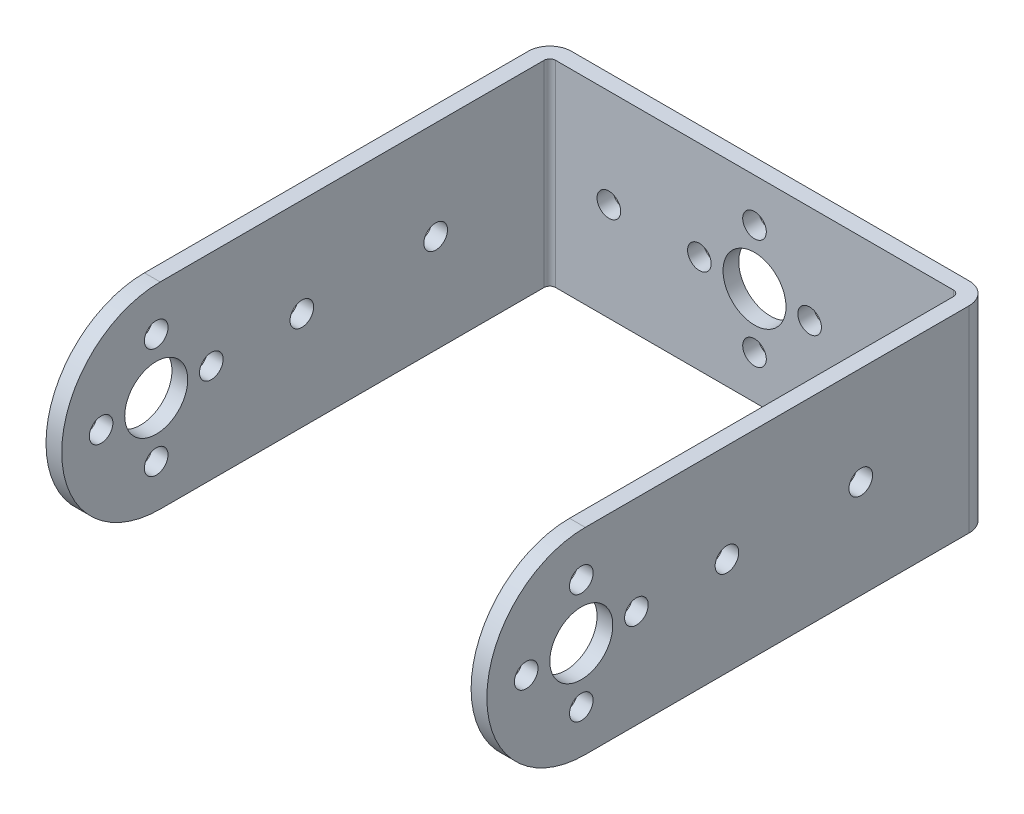
ISO-10303-21;
HEADER;
FILE_DESCRIPTION(('STEP AP214'),'2;1');
FILE_NAME('part.step','',(''),(''),'','','');
FILE_SCHEMA(('AUTOMOTIVE_DESIGN { 1 0 10303 214 1 1 1 1 }'));
ENDSEC;
DATA;
#1=APPLICATION_CONTEXT('core data for automotive mechanical design processes');
#2=APPLICATION_PROTOCOL_DEFINITION('international standard','automotive_design',2000,#1);
#3=PRODUCT_CONTEXT('',#1,'mechanical');
#4=PRODUCT('Part','Part','',(#3));
#5=PRODUCT_RELATED_PRODUCT_CATEGORY('part','',(#4));
#6=PRODUCT_DEFINITION_FORMATION('','',#4);
#7=PRODUCT_DEFINITION_CONTEXT('part definition',#1,'design');
#8=PRODUCT_DEFINITION('design','',#6,#7);
#9=PRODUCT_DEFINITION_SHAPE('','',#8);
#10=(LENGTH_UNIT() NAMED_UNIT(*) SI_UNIT(.MILLI.,.METRE.));
#11=(NAMED_UNIT(*) PLANE_ANGLE_UNIT() SI_UNIT($,.RADIAN.));
#12=(NAMED_UNIT(*) SI_UNIT($,.STERADIAN.) SOLID_ANGLE_UNIT());
#13=UNCERTAINTY_MEASURE_WITH_UNIT(LENGTH_MEASURE(1.E-05),#10,'distance_accuracy_value','');
#14=(GEOMETRIC_REPRESENTATION_CONTEXT(3) GLOBAL_UNCERTAINTY_ASSIGNED_CONTEXT((#13)) GLOBAL_UNIT_ASSIGNED_CONTEXT((#10,
#11,#12)) REPRESENTATION_CONTEXT('',''));
#15=CARTESIAN_POINT('',(0.,0.,0.));
#16=DIRECTION('',(0.,0.,1.));
#17=DIRECTION('',(1.,0.,0.));
#18=AXIS2_PLACEMENT_3D('',#15,#16,#17);
#19=CARTESIAN_POINT('',(-1.,0.,0.));
#20=DIRECTION('',(-1.,0.,0.));
#21=DIRECTION('',(0.,0.,1.));
#22=AXIS2_PLACEMENT_3D('',#19,#20,#21);
#23=PLANE('',#22);
#24=DIRECTION('',(0.,0.,1.));
#25=VECTOR('',#24,1.);
#26=CARTESIAN_POINT('',(-1.,0.,68.));
#27=LINE('',#26,#25);
#28=CARTESIAN_POINT('',(-1.,0.,0.736599999999993));
#29=VERTEX_POINT('',#28);
#30=CARTESIAN_POINT('',(-1.0000000000001,0.,49.5));
#31=VERTEX_POINT('',#30);
#32=EDGE_CURVE('E97',#29,#31,#27,.T.);
#33=ORIENTED_EDGE('',*,*,#32,.F.);
#34=DIRECTION('',(0.,-1.,0.));
#35=VECTOR('',#34,1.);
#36=CARTESIAN_POINT('',(-1.,-25.,0.736599999999991));
#37=LINE('',#36,#35);
#38=CARTESIAN_POINT('',(-1.0000000000001,-25.,0.736599999999995));
#39=VERTEX_POINT('',#38);
#40=EDGE_CURVE('E117',#39,#29,#37,.F.);
#41=ORIENTED_EDGE('',*,*,#40,.F.);
#42=DIRECTION('',(0.,0.,1.));
#43=VECTOR('',#42,1.);
#44=CARTESIAN_POINT('',(-1.0000000000002,-25.,0.));
#45=LINE('',#44,#43);
#46=CARTESIAN_POINT('',(-1.00000000000019,-25.,49.5));
#47=VERTEX_POINT('',#46);
#48=EDGE_CURVE('E114',#47,#39,#45,.F.);
#49=ORIENTED_EDGE('',*,*,#48,.F.);
#50=CARTESIAN_POINT('',(-1.0000000000002,-12.5,49.5));
#51=DIRECTION('',(-1.,0.,0.));
#52=DIRECTION('',(0.,0.,1.));
#53=AXIS2_PLACEMENT_3D('',#50,#51,#52);
#54=CIRCLE('',#53,12.5);
#55=EDGE_CURVE('E103',#31,#47,#54,.F.);
#56=ORIENTED_EDGE('',*,*,#55,.F.);
#57=EDGE_LOOP('',(#33,#41,#49,#56));
#58=FACE_BOUND('',#57,.T.);
#59=CARTESIAN_POINT('',(-1.00000000000005,-12.5,14.5000000000002));
#60=DIRECTION('',(-1.,0.,0.));
#61=DIRECTION('',(0.,0.,1.));
#62=AXIS2_PLACEMENT_3D('',#59,#60,#61);
#63=CIRCLE('',#62,1.5);
#64=CARTESIAN_POINT('',(-1.00000000000006,-12.5,16.0000000000002));
#65=VERTEX_POINT('',#64);
#66=EDGE_CURVE('E138',#65,#65,#63,.F.);
#67=ORIENTED_EDGE('',*,*,#66,.T.);
#68=EDGE_LOOP('',(#67));
#69=FACE_BOUND('',#68,.T.);
#70=CARTESIAN_POINT('',(-1.00000000000017,-19.5,50.));
#71=DIRECTION('',(-1.,0.,0.));
#72=DIRECTION('',(0.,0.,1.));
#73=AXIS2_PLACEMENT_3D('',#70,#71,#72);
#74=CIRCLE('',#73,1.5);
#75=CARTESIAN_POINT('',(-1.00000000000018,-19.5,51.5));
#76=VERTEX_POINT('',#75);
#77=EDGE_CURVE('E281',#76,#76,#74,.F.);
#78=ORIENTED_EDGE('',*,*,#77,.T.);
#79=EDGE_LOOP('',(#78));
#80=FACE_BOUND('',#79,.T.);
#81=CARTESIAN_POINT('',(-1.00000000000018,-5.5,50.));
#82=DIRECTION('',(-1.,0.,0.));
#83=DIRECTION('',(0.,0.,1.));
#84=AXIS2_PLACEMENT_3D('',#81,#82,#83);
#85=CIRCLE('',#84,1.5);
#86=CARTESIAN_POINT('',(-1.00000000000018,-5.5,51.5));
#87=VERTEX_POINT('',#86);
#88=EDGE_CURVE('E284',#87,#87,#85,.F.);
#89=ORIENTED_EDGE('',*,*,#88,.T.);
#90=EDGE_LOOP('',(#89));
#91=FACE_BOUND('',#90,.T.);
#92=CARTESIAN_POINT('',(-1.00000000000017,-12.5,50.));
#93=DIRECTION('',(-1.,0.,0.));
#94=DIRECTION('',(0.,0.,1.));
#95=AXIS2_PLACEMENT_3D('',#92,#93,#94);
#96=CIRCLE('',#95,4.);
#97=CARTESIAN_POINT('',(-1.00000000000019,-12.5,54.));
#98=VERTEX_POINT('',#97);
#99=EDGE_CURVE('E287',#98,#98,#96,.F.);
#100=ORIENTED_EDGE('',*,*,#99,.T.);
#101=EDGE_LOOP('',(#100));
#102=FACE_BOUND('',#101,.T.);
#103=CARTESIAN_POINT('',(-1.0000000000002,-12.5,57.));
#104=DIRECTION('',(-1.,0.,0.));
#105=DIRECTION('',(0.,0.,1.));
#106=AXIS2_PLACEMENT_3D('',#103,#104,#105);
#107=CIRCLE('',#106,1.5);
#108=CARTESIAN_POINT('',(-1.0000000000002,-12.5,58.5));
#109=VERTEX_POINT('',#108);
#110=EDGE_CURVE('E290',#109,#109,#107,.F.);
#111=ORIENTED_EDGE('',*,*,#110,.T.);
#112=EDGE_LOOP('',(#111));
#113=FACE_BOUND('',#112,.T.);
#114=CARTESIAN_POINT('',(-1.00000000000015,-12.5,43.));
#115=DIRECTION('',(-1.,0.,0.));
#116=DIRECTION('',(0.,0.,1.));
#117=AXIS2_PLACEMENT_3D('',#114,#115,#116);
#118=CIRCLE('',#117,1.5);
#119=CARTESIAN_POINT('',(-1.00000000000015,-12.5,44.5));
#120=VERTEX_POINT('',#119);
#121=EDGE_CURVE('E292',#120,#120,#118,.F.);
#122=ORIENTED_EDGE('',*,*,#121,.T.);
#123=EDGE_LOOP('',(#122));
#124=FACE_BOUND('',#123,.T.);
#125=CARTESIAN_POINT('',(-1.00000000000011,-12.5,31.5));
#126=DIRECTION('',(-1.,0.,0.));
#127=DIRECTION('',(0.,0.,1.));
#128=AXIS2_PLACEMENT_3D('',#125,#126,#127);
#129=CIRCLE('',#128,1.5);
#130=CARTESIAN_POINT('',(-1.00000000000012,-12.5,33.));
#131=VERTEX_POINT('',#130);
#132=EDGE_CURVE('E20',#131,#131,#129,.F.);
#133=ORIENTED_EDGE('',*,*,#132,.T.);
#134=EDGE_LOOP('',(#133));
#135=FACE_BOUND('',#134,.T.);
#136=ADVANCED_FACE('F17',(#58,#69,#80,#91,#102,#113,#124,#135),#23,.T.);
#137=CARTESIAN_POINT('',(1.7366,-25.,0.7366));
#138=DIRECTION('',(0.,-1.,0.));
#139=DIRECTION('',(0.,0.,-1.));
#140=AXIS2_PLACEMENT_3D('',#137,#138,#139);
#141=CYLINDRICAL_SURFACE('',#140,2.7366);
#142=ORIENTED_EDGE('',*,*,#40,.T.);
#143=CARTESIAN_POINT('',(1.7366,0.,0.736599999999998));
#144=DIRECTION('',(0.,-1.,0.));
#145=DIRECTION('',(0.,0.,-1.));
#146=AXIS2_PLACEMENT_3D('',#143,#144,#145);
#147=CIRCLE('',#146,2.7366);
#148=CARTESIAN_POINT('',(1.7366,0.,-2.));
#149=VERTEX_POINT('',#148);
#150=EDGE_CURVE('E271',#149,#29,#147,.F.);
#151=ORIENTED_EDGE('',*,*,#150,.F.);
#152=DIRECTION('',(0.,1.,0.));
#153=VECTOR('',#152,1.);
#154=CARTESIAN_POINT('',(1.7366,0.,-2.));
#155=LINE('',#154,#153);
#156=CARTESIAN_POINT('',(1.7366,-25.,-2.));
#157=VERTEX_POINT('',#156);
#158=EDGE_CURVE('E275',#149,#157,#155,.F.);
#159=ORIENTED_EDGE('',*,*,#158,.T.);
#160=CARTESIAN_POINT('',(1.7366,-25.,0.7366));
#161=DIRECTION('',(0.,-1.,0.));
#162=DIRECTION('',(0.,0.,-1.));
#163=AXIS2_PLACEMENT_3D('',#160,#161,#162);
#164=CIRCLE('',#163,2.7366);
#165=EDGE_CURVE('E111',#157,#39,#164,.F.);
#166=ORIENTED_EDGE('',*,*,#165,.T.);
#167=EDGE_LOOP('',(#142,#151,#159,#166));
#168=FACE_BOUND('',#167,.T.);
#169=ADVANCED_FACE('F303',(#168),#141,.T.);
#170=CARTESIAN_POINT('',(-1.00000000000011,-12.5,31.5));
#171=DIRECTION('',(-1.,0.,0.));
#172=DIRECTION('',(0.,0.,1.));
#173=AXIS2_PLACEMENT_3D('',#170,#171,#172);
#174=CYLINDRICAL_SURFACE('',#173,1.5);
#175=CARTESIAN_POINT('',(0.999999999999888,-12.5,31.5));
#176=DIRECTION('',(-1.,0.,0.));
#177=DIRECTION('',(0.,0.,1.));
#178=AXIS2_PLACEMENT_3D('',#175,#176,#177);
#179=CIRCLE('',#178,1.5);
#180=CARTESIAN_POINT('',(0.999999999999883,-12.5,33.));
#181=VERTEX_POINT('',#180);
#182=EDGE_CURVE('E268',#181,#181,#179,.F.);
#183=ORIENTED_EDGE('',*,*,#182,.T.);
#184=EDGE_LOOP('',(#183));
#185=FACE_BOUND('',#184,.T.);
#186=ORIENTED_EDGE('',*,*,#132,.F.);
#187=EDGE_LOOP('',(#186));
#188=FACE_BOUND('',#187,.T.);
#189=ADVANCED_FACE('F300',(#185,#188),#174,.F.);
#190=CARTESIAN_POINT('',(-1.00000000000015,-12.5,43.));
#191=DIRECTION('',(-1.,0.,0.));
#192=DIRECTION('',(0.,0.,1.));
#193=AXIS2_PLACEMENT_3D('',#190,#191,#192);
#194=CYLINDRICAL_SURFACE('',#193,1.5);
#195=CARTESIAN_POINT('',(0.99999999999985,-12.5,43.));
#196=DIRECTION('',(-1.,0.,0.));
#197=DIRECTION('',(0.,0.,1.));
#198=AXIS2_PLACEMENT_3D('',#195,#196,#197);
#199=CIRCLE('',#198,1.5);
#200=CARTESIAN_POINT('',(0.999999999999845,-12.5,44.5));
#201=VERTEX_POINT('',#200);
#202=EDGE_CURVE('E265',#201,#201,#199,.F.);
#203=ORIENTED_EDGE('',*,*,#202,.T.);
#204=EDGE_LOOP('',(#203));
#205=FACE_BOUND('',#204,.T.);
#206=ORIENTED_EDGE('',*,*,#121,.F.);
#207=EDGE_LOOP('',(#206));
#208=FACE_BOUND('',#207,.T.);
#209=ADVANCED_FACE('F302',(#205,#208),#194,.F.);
#210=CARTESIAN_POINT('',(-1.0000000000002,-12.5,57.));
#211=DIRECTION('',(-1.,0.,0.));
#212=DIRECTION('',(0.,0.,1.));
#213=AXIS2_PLACEMENT_3D('',#210,#211,#212);
#214=CYLINDRICAL_SURFACE('',#213,1.5);
#215=CARTESIAN_POINT('',(0.999999999999801,-12.5,57.));
#216=DIRECTION('',(-1.,0.,0.));
#217=DIRECTION('',(0.,0.,1.));
#218=AXIS2_PLACEMENT_3D('',#215,#216,#217);
#219=CIRCLE('',#218,1.5);
#220=CARTESIAN_POINT('',(0.999999999999796,-12.5,58.5));
#221=VERTEX_POINT('',#220);
#222=EDGE_CURVE('E262',#221,#221,#219,.F.);
#223=ORIENTED_EDGE('',*,*,#222,.T.);
#224=EDGE_LOOP('',(#223));
#225=FACE_BOUND('',#224,.T.);
#226=ORIENTED_EDGE('',*,*,#110,.F.);
#227=EDGE_LOOP('',(#226));
#228=FACE_BOUND('',#227,.T.);
#229=ADVANCED_FACE('F311',(#225,#228),#214,.F.);
#230=CARTESIAN_POINT('',(-1.00000000000017,-12.5,50.));
#231=DIRECTION('',(-1.,0.,0.));
#232=DIRECTION('',(0.,0.,1.));
#233=AXIS2_PLACEMENT_3D('',#230,#231,#232);
#234=CYLINDRICAL_SURFACE('',#233,4.);
#235=CARTESIAN_POINT('',(0.999999999999826,-12.5,50.));
#236=DIRECTION('',(-1.,0.,0.));
#237=DIRECTION('',(0.,0.,1.));
#238=AXIS2_PLACEMENT_3D('',#235,#236,#237);
#239=CIRCLE('',#238,4.);
#240=CARTESIAN_POINT('',(0.999999999999812,-12.5,54.));
#241=VERTEX_POINT('',#240);
#242=EDGE_CURVE('E259',#241,#241,#239,.F.);
#243=ORIENTED_EDGE('',*,*,#242,.T.);
#244=EDGE_LOOP('',(#243));
#245=FACE_BOUND('',#244,.T.);
#246=ORIENTED_EDGE('',*,*,#99,.F.);
#247=EDGE_LOOP('',(#246));
#248=FACE_BOUND('',#247,.T.);
#249=ADVANCED_FACE('F430',(#245,#248),#234,.F.);
#250=CARTESIAN_POINT('',(-1.00000000000017,-5.5,50.));
#251=DIRECTION('',(-1.,0.,0.));
#252=DIRECTION('',(0.,0.,1.));
#253=AXIS2_PLACEMENT_3D('',#250,#251,#252);
#254=CYLINDRICAL_SURFACE('',#253,1.5);
#255=CARTESIAN_POINT('',(0.999999999999825,-5.5,50.));
#256=DIRECTION('',(-1.,0.,0.));
#257=DIRECTION('',(0.,0.,1.));
#258=AXIS2_PLACEMENT_3D('',#255,#256,#257);
#259=CIRCLE('',#258,1.5);
#260=CARTESIAN_POINT('',(0.99999999999982,-5.5,51.5));
#261=VERTEX_POINT('',#260);
#262=EDGE_CURVE('E256',#261,#261,#259,.F.);
#263=ORIENTED_EDGE('',*,*,#262,.T.);
#264=EDGE_LOOP('',(#263));
#265=FACE_BOUND('',#264,.T.);
#266=ORIENTED_EDGE('',*,*,#88,.F.);
#267=EDGE_LOOP('',(#266));
#268=FACE_BOUND('',#267,.T.);
#269=ADVANCED_FACE('F426',(#265,#268),#254,.F.);
#270=CARTESIAN_POINT('',(-1.00000000000017,-19.5,50.));
#271=DIRECTION('',(-1.,0.,0.));
#272=DIRECTION('',(0.,0.,1.));
#273=AXIS2_PLACEMENT_3D('',#270,#271,#272);
#274=CYLINDRICAL_SURFACE('',#273,1.5);
#275=CARTESIAN_POINT('',(0.999999999999829,-19.5,50.));
#276=DIRECTION('',(-1.,0.,0.));
#277=DIRECTION('',(0.,0.,1.));
#278=AXIS2_PLACEMENT_3D('',#275,#276,#277);
#279=CIRCLE('',#278,1.5);
#280=CARTESIAN_POINT('',(0.999999999999824,-19.5,51.5));
#281=VERTEX_POINT('',#280);
#282=EDGE_CURVE('E253',#281,#281,#279,.F.);
#283=ORIENTED_EDGE('',*,*,#282,.T.);
#284=EDGE_LOOP('',(#283));
#285=FACE_BOUND('',#284,.T.);
#286=ORIENTED_EDGE('',*,*,#77,.F.);
#287=EDGE_LOOP('',(#286));
#288=FACE_BOUND('',#287,.T.);
#289=ADVANCED_FACE('F422',(#285,#288),#274,.F.);
#290=CARTESIAN_POINT('',(-1.00000000000005,-12.5,14.5000000000002));
#291=DIRECTION('',(-1.,0.,0.));
#292=DIRECTION('',(0.,0.,1.));
#293=AXIS2_PLACEMENT_3D('',#290,#291,#292);
#294=CYLINDRICAL_SURFACE('',#293,1.5);
#295=CARTESIAN_POINT('',(0.999999999999947,-12.5,14.5000000000002));
#296=DIRECTION('',(-1.,0.,0.));
#297=DIRECTION('',(0.,0.,1.));
#298=AXIS2_PLACEMENT_3D('',#295,#296,#297);
#299=CIRCLE('',#298,1.5);
#300=CARTESIAN_POINT('',(0.999999999999942,-12.5,16.0000000000002));
#301=VERTEX_POINT('',#300);
#302=EDGE_CURVE('E249',#301,#301,#299,.F.);
#303=ORIENTED_EDGE('',*,*,#302,.T.);
#304=EDGE_LOOP('',(#303));
#305=FACE_BOUND('',#304,.T.);
#306=ORIENTED_EDGE('',*,*,#66,.F.);
#307=EDGE_LOOP('',(#306));
#308=FACE_BOUND('',#307,.T.);
#309=ADVANCED_FACE('F419',(#305,#308),#294,.F.);
#310=CARTESIAN_POINT('',(-1.00000000000017,-12.5,49.5));
#311=DIRECTION('',(-1.,0.,0.));
#312=DIRECTION('',(0.,0.,1.));
#313=AXIS2_PLACEMENT_3D('',#310,#311,#312);
#314=CYLINDRICAL_SURFACE('',#313,12.5);
#315=DIRECTION('',(-1.,0.,0.));
#316=VECTOR('',#315,1.);
#317=CARTESIAN_POINT('',(-1.00000000000018,0.,49.5));
#318=LINE('',#317,#316);
#319=CARTESIAN_POINT('',(0.999999999999824,0.,49.5));
#320=VERTEX_POINT('',#319);
#321=EDGE_CURVE('E109',#320,#31,#318,.T.);
#322=ORIENTED_EDGE('',*,*,#321,.T.);
#323=ORIENTED_EDGE('',*,*,#55,.T.);
#324=DIRECTION('',(-1.,0.,0.));
#325=VECTOR('',#324,1.);
#326=CARTESIAN_POINT('',(-1.00000000000017,-25.,49.5));
#327=LINE('',#326,#325);
#328=CARTESIAN_POINT('',(0.99999999999983,-25.,49.5));
#329=VERTEX_POINT('',#328);
#330=EDGE_CURVE('E108',#47,#329,#327,.F.);
#331=ORIENTED_EDGE('',*,*,#330,.T.);
#332=CARTESIAN_POINT('',(0.999999999999826,-12.5,49.5));
#333=DIRECTION('',(-1.,0.,0.));
#334=DIRECTION('',(0.,0.,1.));
#335=AXIS2_PLACEMENT_3D('',#332,#333,#334);
#336=CIRCLE('',#335,12.5);
#337=EDGE_CURVE('E247',#329,#320,#336,.T.);
#338=ORIENTED_EDGE('',*,*,#337,.T.);
#339=EDGE_LOOP('',(#322,#323,#331,#338));
#340=FACE_BOUND('',#339,.T.);
#341=ADVANCED_FACE('F105',(#340),#314,.T.);
#342=CARTESIAN_POINT('',(0.,0.,-2.));
#343=DIRECTION('',(0.,0.,1.));
#344=DIRECTION('',(1.,0.,0.));
#345=AXIS2_PLACEMENT_3D('',#342,#343,#344);
#346=PLANE('',#345);
#347=DIRECTION('',(1.,0.,0.));
#348=VECTOR('',#347,1.);
#349=CARTESIAN_POINT('',(0.,-25.,-2.));
#350=LINE('',#349,#348);
#351=CARTESIAN_POINT('',(52.2634,-25.,-2.));
#352=VERTEX_POINT('',#351);
#353=EDGE_CURVE('E227',#157,#352,#350,.T.);
#354=ORIENTED_EDGE('',*,*,#353,.F.);
#355=ORIENTED_EDGE('',*,*,#158,.F.);
#356=DIRECTION('',(1.,0.,0.));
#357=VECTOR('',#356,1.);
#358=CARTESIAN_POINT('',(0.,0.,-2.));
#359=LINE('',#358,#357);
#360=CARTESIAN_POINT('',(52.2634,0.,-2.));
#361=VERTEX_POINT('',#360);
#362=EDGE_CURVE('E136',#361,#149,#359,.F.);
#363=ORIENTED_EDGE('',*,*,#362,.F.);
#364=DIRECTION('',(0.,1.,0.));
#365=VECTOR('',#364,1.);
#366=CARTESIAN_POINT('',(52.2634,0.,-2.));
#367=LINE('',#366,#365);
#368=EDGE_CURVE('E246',#352,#361,#367,.T.);
#369=ORIENTED_EDGE('',*,*,#368,.F.);
#370=EDGE_LOOP('',(#354,#355,#363,#369));
#371=FACE_BOUND('',#370,.T.);
#372=CARTESIAN_POINT('',(8.5,-12.5,-2.));
#373=DIRECTION('',(0.,0.,1.));
#374=DIRECTION('',(1.,0.,0.));
#375=AXIS2_PLACEMENT_3D('',#372,#373,#374);
#376=CIRCLE('',#375,1.5);
#377=CARTESIAN_POINT('',(10.,-12.5,-2.));
#378=VERTEX_POINT('',#377);
#379=EDGE_CURVE('E224',#378,#378,#376,.T.);
#380=ORIENTED_EDGE('',*,*,#379,.T.);
#381=EDGE_LOOP('',(#380));
#382=FACE_BOUND('',#381,.T.);
#383=CARTESIAN_POINT('',(45.5,-12.5,-2.));
#384=DIRECTION('',(0.,0.,1.));
#385=DIRECTION('',(1.,0.,0.));
#386=AXIS2_PLACEMENT_3D('',#383,#384,#385);
#387=CIRCLE('',#386,1.5);
#388=CARTESIAN_POINT('',(47.,-12.5,-2.));
#389=VERTEX_POINT('',#388);
#390=EDGE_CURVE('E228',#389,#389,#387,.T.);
#391=ORIENTED_EDGE('',*,*,#390,.T.);
#392=EDGE_LOOP('',(#391));
#393=FACE_BOUND('',#392,.T.);
#394=CARTESIAN_POINT('',(20.,-12.5,-2.));
#395=DIRECTION('',(0.,0.,1.));
#396=DIRECTION('',(1.,0.,0.));
#397=AXIS2_PLACEMENT_3D('',#394,#395,#396);
#398=CIRCLE('',#397,1.5);
#399=CARTESIAN_POINT('',(21.5,-12.5,-2.));
#400=VERTEX_POINT('',#399);
#401=EDGE_CURVE('E231',#400,#400,#398,.T.);
#402=ORIENTED_EDGE('',*,*,#401,.T.);
#403=EDGE_LOOP('',(#402));
#404=FACE_BOUND('',#403,.T.);
#405=CARTESIAN_POINT('',(34.,-12.5,-2.));
#406=DIRECTION('',(0.,0.,1.));
#407=DIRECTION('',(1.,0.,0.));
#408=AXIS2_PLACEMENT_3D('',#405,#406,#407);
#409=CIRCLE('',#408,1.5);
#410=CARTESIAN_POINT('',(35.5,-12.5,-2.));
#411=VERTEX_POINT('',#410);
#412=EDGE_CURVE('E234',#411,#411,#409,.T.);
#413=ORIENTED_EDGE('',*,*,#412,.T.);
#414=EDGE_LOOP('',(#413));
#415=FACE_BOUND('',#414,.T.);
#416=CARTESIAN_POINT('',(27.,-19.5,-2.));
#417=DIRECTION('',(0.,0.,1.));
#418=DIRECTION('',(1.,0.,0.));
#419=AXIS2_PLACEMENT_3D('',#416,#417,#418);
#420=CIRCLE('',#419,1.5);
#421=CARTESIAN_POINT('',(28.5,-19.5,-2.));
#422=VERTEX_POINT('',#421);
#423=EDGE_CURVE('E237',#422,#422,#420,.T.);
#424=ORIENTED_EDGE('',*,*,#423,.T.);
#425=EDGE_LOOP('',(#424));
#426=FACE_BOUND('',#425,.T.);
#427=CARTESIAN_POINT('',(27.,-5.5,-2.));
#428=DIRECTION('',(0.,0.,1.));
#429=DIRECTION('',(1.,0.,0.));
#430=AXIS2_PLACEMENT_3D('',#427,#428,#429);
#431=CIRCLE('',#430,1.5);
#432=CARTESIAN_POINT('',(28.5,-5.5,-2.));
#433=VERTEX_POINT('',#432);
#434=EDGE_CURVE('E240',#433,#433,#431,.T.);
#435=ORIENTED_EDGE('',*,*,#434,.T.);
#436=EDGE_LOOP('',(#435));
#437=FACE_BOUND('',#436,.T.);
#438=CARTESIAN_POINT('',(27.,-12.5,-2.));
#439=DIRECTION('',(0.,0.,1.));
#440=DIRECTION('',(1.,0.,0.));
#441=AXIS2_PLACEMENT_3D('',#438,#439,#440);
#442=CIRCLE('',#441,4.);
#443=CARTESIAN_POINT('',(31.,-12.5,-2.));
#444=VERTEX_POINT('',#443);
#445=EDGE_CURVE('E243',#444,#444,#442,.T.);
#446=ORIENTED_EDGE('',*,*,#445,.T.);
#447=EDGE_LOOP('',(#446));
#448=FACE_BOUND('',#447,.T.);
#449=ADVANCED_FACE('F412',(#371,#382,#393,#404,#415,#426,#437,#448),#346,.F.);
#450=CARTESIAN_POINT('',(1.,0.,0.));
#451=DIRECTION('',(-1.,0.,0.));
#452=DIRECTION('',(0.,0.,1.));
#453=AXIS2_PLACEMENT_3D('',#450,#451,#452);
#454=PLANE('',#453);
#455=ORIENTED_EDGE('',*,*,#337,.F.);
#456=DIRECTION('',(0.,0.,1.));
#457=VECTOR('',#456,1.);
#458=CARTESIAN_POINT('',(1.,-25.,0.));
#459=LINE('',#458,#457);
#460=CARTESIAN_POINT('',(1.,-25.,0.736599999999996));
#461=VERTEX_POINT('',#460);
#462=EDGE_CURVE('E127',#461,#329,#459,.T.);
#463=ORIENTED_EDGE('',*,*,#462,.F.);
#464=DIRECTION('',(0.,-1.,0.));
#465=VECTOR('',#464,1.);
#466=CARTESIAN_POINT('',(1.,-25.,0.7366));
#467=LINE('',#466,#465);
#468=CARTESIAN_POINT('',(0.999999999999999,0.,0.736599999999994));
#469=VERTEX_POINT('',#468);
#470=EDGE_CURVE('E132',#461,#469,#467,.F.);
#471=ORIENTED_EDGE('',*,*,#470,.T.);
#472=DIRECTION('',(0.,0.,1.));
#473=VECTOR('',#472,1.);
#474=CARTESIAN_POINT('',(1.,0.,0.));
#475=LINE('',#474,#473);
#476=EDGE_CURVE('E252',#320,#469,#475,.F.);
#477=ORIENTED_EDGE('',*,*,#476,.F.);
#478=EDGE_LOOP('',(#455,#463,#471,#477));
#479=FACE_BOUND('',#478,.T.);
#480=ORIENTED_EDGE('',*,*,#302,.F.);
#481=EDGE_LOOP('',(#480));
#482=FACE_BOUND('',#481,.T.);
#483=ORIENTED_EDGE('',*,*,#282,.F.);
#484=EDGE_LOOP('',(#483));
#485=FACE_BOUND('',#484,.T.);
#486=ORIENTED_EDGE('',*,*,#262,.F.);
#487=EDGE_LOOP('',(#486));
#488=FACE_BOUND('',#487,.T.);
#489=ORIENTED_EDGE('',*,*,#242,.F.);
#490=EDGE_LOOP('',(#489));
#491=FACE_BOUND('',#490,.T.);
#492=ORIENTED_EDGE('',*,*,#222,.F.);
#493=EDGE_LOOP('',(#492));
#494=FACE_BOUND('',#493,.T.);
#495=ORIENTED_EDGE('',*,*,#202,.F.);
#496=EDGE_LOOP('',(#495));
#497=FACE_BOUND('',#496,.T.);
#498=ORIENTED_EDGE('',*,*,#182,.F.);
#499=EDGE_LOOP('',(#498));
#500=FACE_BOUND('',#499,.T.);
#501=ADVANCED_FACE('F408',(#479,#482,#485,#488,#491,#494,#497,#500),#454,.F.);
#502=CARTESIAN_POINT('',(52.2634,0.,0.7366));
#503=DIRECTION('',(0.,1.,0.));
#504=DIRECTION('',(0.,0.,1.));
#505=AXIS2_PLACEMENT_3D('',#502,#503,#504);
#506=CYLINDRICAL_SURFACE('',#505,2.7366);
#507=DIRECTION('',(0.,1.,0.));
#508=VECTOR('',#507,1.);
#509=CARTESIAN_POINT('',(55.,0.,0.73659999999999));
#510=LINE('',#509,#508);
#511=CARTESIAN_POINT('',(55.,0.,0.736599999999995));
#512=VERTEX_POINT('',#511);
#513=CARTESIAN_POINT('',(55.,-25.,0.736599999999995));
#514=VERTEX_POINT('',#513);
#515=EDGE_CURVE('E218',#512,#514,#510,.F.);
#516=ORIENTED_EDGE('',*,*,#515,.T.);
#517=CARTESIAN_POINT('',(52.2634,-25.,0.7366));
#518=DIRECTION('',(0.,1.,0.));
#519=DIRECTION('',(0.,0.,1.));
#520=AXIS2_PLACEMENT_3D('',#517,#518,#519);
#521=CIRCLE('',#520,2.7366);
#522=EDGE_CURVE('E219',#352,#514,#521,.F.);
#523=ORIENTED_EDGE('',*,*,#522,.F.);
#524=ORIENTED_EDGE('',*,*,#368,.T.);
#525=CARTESIAN_POINT('',(52.2634,0.,0.7366));
#526=DIRECTION('',(0.,1.,0.));
#527=DIRECTION('',(0.,0.,1.));
#528=AXIS2_PLACEMENT_3D('',#525,#526,#527);
#529=CIRCLE('',#528,2.7366);
#530=EDGE_CURVE('E216',#361,#512,#529,.F.);
#531=ORIENTED_EDGE('',*,*,#530,.T.);
#532=EDGE_LOOP('',(#516,#523,#524,#531));
#533=FACE_BOUND('',#532,.T.);
#534=ADVANCED_FACE('F404',(#533),#506,.T.);
#535=CARTESIAN_POINT('',(27.,-12.5,-2.));
#536=DIRECTION('',(0.,0.,1.));
#537=DIRECTION('',(1.,0.,0.));
#538=AXIS2_PLACEMENT_3D('',#535,#536,#537);
#539=CYLINDRICAL_SURFACE('',#538,4.);
#540=CARTESIAN_POINT('',(27.,-12.5,0.));
#541=DIRECTION('',(0.,0.,1.));
#542=DIRECTION('',(1.,0.,0.));
#543=AXIS2_PLACEMENT_3D('',#540,#541,#542);
#544=CIRCLE('',#543,4.);
#545=CARTESIAN_POINT('',(31.,-12.5,0.));
#546=VERTEX_POINT('',#545);
#547=EDGE_CURVE('E212',#546,#546,#544,.F.);
#548=ORIENTED_EDGE('',*,*,#547,.F.);
#549=EDGE_LOOP('',(#548));
#550=FACE_BOUND('',#549,.T.);
#551=ORIENTED_EDGE('',*,*,#445,.F.);
#552=EDGE_LOOP('',(#551));
#553=FACE_BOUND('',#552,.T.);
#554=ADVANCED_FACE('F400',(#550,#553),#539,.F.);
#555=CARTESIAN_POINT('',(27.,-5.5,-2.));
#556=DIRECTION('',(0.,0.,1.));
#557=DIRECTION('',(1.,0.,0.));
#558=AXIS2_PLACEMENT_3D('',#555,#556,#557);
#559=CYLINDRICAL_SURFACE('',#558,1.5);
#560=CARTESIAN_POINT('',(27.,-5.5,0.));
#561=DIRECTION('',(0.,0.,1.));
#562=DIRECTION('',(1.,0.,0.));
#563=AXIS2_PLACEMENT_3D('',#560,#561,#562);
#564=CIRCLE('',#563,1.5);
#565=CARTESIAN_POINT('',(28.5,-5.5,0.));
#566=VERTEX_POINT('',#565);
#567=EDGE_CURVE('E209',#566,#566,#564,.F.);
#568=ORIENTED_EDGE('',*,*,#567,.F.);
#569=EDGE_LOOP('',(#568));
#570=FACE_BOUND('',#569,.T.);
#571=ORIENTED_EDGE('',*,*,#434,.F.);
#572=EDGE_LOOP('',(#571));
#573=FACE_BOUND('',#572,.T.);
#574=ADVANCED_FACE('F396',(#570,#573),#559,.F.);
#575=CARTESIAN_POINT('',(27.,-19.5,-2.));
#576=DIRECTION('',(0.,0.,1.));
#577=DIRECTION('',(1.,0.,0.));
#578=AXIS2_PLACEMENT_3D('',#575,#576,#577);
#579=CYLINDRICAL_SURFACE('',#578,1.5);
#580=CARTESIAN_POINT('',(27.,-19.5,0.));
#581=DIRECTION('',(0.,0.,1.));
#582=DIRECTION('',(1.,0.,0.));
#583=AXIS2_PLACEMENT_3D('',#580,#581,#582);
#584=CIRCLE('',#583,1.5);
#585=CARTESIAN_POINT('',(28.5,-19.5,0.));
#586=VERTEX_POINT('',#585);
#587=EDGE_CURVE('E206',#586,#586,#584,.F.);
#588=ORIENTED_EDGE('',*,*,#587,.F.);
#589=EDGE_LOOP('',(#588));
#590=FACE_BOUND('',#589,.T.);
#591=ORIENTED_EDGE('',*,*,#423,.F.);
#592=EDGE_LOOP('',(#591));
#593=FACE_BOUND('',#592,.T.);
#594=ADVANCED_FACE('F392',(#590,#593),#579,.F.);
#595=CARTESIAN_POINT('',(34.,-12.5,-2.));
#596=DIRECTION('',(0.,0.,1.));
#597=DIRECTION('',(1.,0.,0.));
#598=AXIS2_PLACEMENT_3D('',#595,#596,#597);
#599=CYLINDRICAL_SURFACE('',#598,1.5);
#600=CARTESIAN_POINT('',(34.,-12.5,0.));
#601=DIRECTION('',(0.,0.,1.));
#602=DIRECTION('',(1.,0.,0.));
#603=AXIS2_PLACEMENT_3D('',#600,#601,#602);
#604=CIRCLE('',#603,1.5);
#605=CARTESIAN_POINT('',(35.5,-12.5,0.));
#606=VERTEX_POINT('',#605);
#607=EDGE_CURVE('E203',#606,#606,#604,.F.);
#608=ORIENTED_EDGE('',*,*,#607,.F.);
#609=EDGE_LOOP('',(#608));
#610=FACE_BOUND('',#609,.T.);
#611=ORIENTED_EDGE('',*,*,#412,.F.);
#612=EDGE_LOOP('',(#611));
#613=FACE_BOUND('',#612,.T.);
#614=ADVANCED_FACE('F388',(#610,#613),#599,.F.);
#615=CARTESIAN_POINT('',(20.,-12.5,-2.));
#616=DIRECTION('',(0.,0.,1.));
#617=DIRECTION('',(1.,0.,0.));
#618=AXIS2_PLACEMENT_3D('',#615,#616,#617);
#619=CYLINDRICAL_SURFACE('',#618,1.5);
#620=CARTESIAN_POINT('',(20.,-12.5,0.));
#621=DIRECTION('',(0.,0.,1.));
#622=DIRECTION('',(1.,0.,0.));
#623=AXIS2_PLACEMENT_3D('',#620,#621,#622);
#624=CIRCLE('',#623,1.5);
#625=CARTESIAN_POINT('',(21.5,-12.5,0.));
#626=VERTEX_POINT('',#625);
#627=EDGE_CURVE('E200',#626,#626,#624,.F.);
#628=ORIENTED_EDGE('',*,*,#627,.F.);
#629=EDGE_LOOP('',(#628));
#630=FACE_BOUND('',#629,.T.);
#631=ORIENTED_EDGE('',*,*,#401,.F.);
#632=EDGE_LOOP('',(#631));
#633=FACE_BOUND('',#632,.T.);
#634=ADVANCED_FACE('F384',(#630,#633),#619,.F.);
#635=CARTESIAN_POINT('',(45.5,-12.5,-2.));
#636=DIRECTION('',(0.,0.,1.));
#637=DIRECTION('',(1.,0.,0.));
#638=AXIS2_PLACEMENT_3D('',#635,#636,#637);
#639=CYLINDRICAL_SURFACE('',#638,1.5);
#640=CARTESIAN_POINT('',(45.5,-12.5,0.));
#641=DIRECTION('',(0.,0.,1.));
#642=DIRECTION('',(1.,0.,0.));
#643=AXIS2_PLACEMENT_3D('',#640,#641,#642);
#644=CIRCLE('',#643,1.5);
#645=CARTESIAN_POINT('',(47.,-12.5,0.));
#646=VERTEX_POINT('',#645);
#647=EDGE_CURVE('E197',#646,#646,#644,.F.);
#648=ORIENTED_EDGE('',*,*,#647,.F.);
#649=EDGE_LOOP('',(#648));
#650=FACE_BOUND('',#649,.T.);
#651=ORIENTED_EDGE('',*,*,#390,.F.);
#652=EDGE_LOOP('',(#651));
#653=FACE_BOUND('',#652,.T.);
#654=ADVANCED_FACE('F380',(#650,#653),#639,.F.);
#655=CARTESIAN_POINT('',(8.5,-12.5,-2.));
#656=DIRECTION('',(0.,0.,1.));
#657=DIRECTION('',(1.,0.,0.));
#658=AXIS2_PLACEMENT_3D('',#655,#656,#657);
#659=CYLINDRICAL_SURFACE('',#658,1.5);
#660=CARTESIAN_POINT('',(8.5,-12.5,0.));
#661=DIRECTION('',(0.,0.,1.));
#662=DIRECTION('',(1.,0.,0.));
#663=AXIS2_PLACEMENT_3D('',#660,#661,#662);
#664=CIRCLE('',#663,1.5);
#665=CARTESIAN_POINT('',(10.,-12.5,0.));
#666=VERTEX_POINT('',#665);
#667=EDGE_CURVE('E193',#666,#666,#664,.F.);
#668=ORIENTED_EDGE('',*,*,#667,.F.);
#669=EDGE_LOOP('',(#668));
#670=FACE_BOUND('',#669,.T.);
#671=ORIENTED_EDGE('',*,*,#379,.F.);
#672=EDGE_LOOP('',(#671));
#673=FACE_BOUND('',#672,.T.);
#674=ADVANCED_FACE('F376',(#670,#673),#659,.F.);
#675=CARTESIAN_POINT('',(1.7366,-25.,0.7366));
#676=DIRECTION('',(0.,-1.,0.));
#677=DIRECTION('',(0.,0.,-1.));
#678=AXIS2_PLACEMENT_3D('',#675,#676,#677);
#679=CYLINDRICAL_SURFACE('',#678,0.7366);
#680=CARTESIAN_POINT('',(1.7366,0.,0.736599999999998));
#681=DIRECTION('',(0.,-1.,0.));
#682=DIRECTION('',(0.,0.,-1.));
#683=AXIS2_PLACEMENT_3D('',#680,#681,#682);
#684=CIRCLE('',#683,0.7366);
#685=CARTESIAN_POINT('',(1.7366,0.,0.));
#686=VERTEX_POINT('',#685);
#687=EDGE_CURVE('E273',#469,#686,#684,.T.);
#688=ORIENTED_EDGE('',*,*,#687,.F.);
#689=ORIENTED_EDGE('',*,*,#470,.F.);
#690=CARTESIAN_POINT('',(1.7366,-25.,0.7366));
#691=DIRECTION('',(0.,-1.,0.));
#692=DIRECTION('',(0.,0.,-1.));
#693=AXIS2_PLACEMENT_3D('',#690,#691,#692);
#694=CIRCLE('',#693,0.7366);
#695=CARTESIAN_POINT('',(1.7366,-25.,0.));
#696=VERTEX_POINT('',#695);
#697=EDGE_CURVE('E276',#461,#696,#694,.T.);
#698=ORIENTED_EDGE('',*,*,#697,.T.);
#699=DIRECTION('',(0.,1.,0.));
#700=VECTOR('',#699,1.);
#701=CARTESIAN_POINT('',(1.7366,0.,0.));
#702=LINE('',#701,#700);
#703=EDGE_CURVE('E192',#686,#696,#702,.F.);
#704=ORIENTED_EDGE('',*,*,#703,.F.);
#705=EDGE_LOOP('',(#688,#689,#698,#704));
#706=FACE_BOUND('',#705,.T.);
#707=ADVANCED_FACE('F372',(#706),#679,.F.);
#708=CARTESIAN_POINT('',(55.,0.,-1.94333098083182E-13));
#709=DIRECTION('',(-1.,0.,0.));
#710=DIRECTION('',(0.,0.,1.));
#711=AXIS2_PLACEMENT_3D('',#708,#709,#710);
#712=PLANE('',#711);
#713=CARTESIAN_POINT('',(55.,-12.5,49.5));
#714=DIRECTION('',(-1.,0.,0.));
#715=DIRECTION('',(0.,0.,1.));
#716=AXIS2_PLACEMENT_3D('',#713,#714,#715);
#717=CIRCLE('',#716,12.5);
#718=CARTESIAN_POINT('',(55.,-25.,49.5));
#719=VERTEX_POINT('',#718);
#720=CARTESIAN_POINT('',(55.,0.,49.5));
#721=VERTEX_POINT('',#720);
#722=EDGE_CURVE('E165',#719,#721,#717,.T.);
#723=ORIENTED_EDGE('',*,*,#722,.F.);
#724=DIRECTION('',(0.,0.,-1.));
#725=VECTOR('',#724,1.);
#726=CARTESIAN_POINT('',(55.,-25.,0.));
#727=LINE('',#726,#725);
#728=EDGE_CURVE('E173',#514,#719,#727,.F.);
#729=ORIENTED_EDGE('',*,*,#728,.F.);
#730=ORIENTED_EDGE('',*,*,#515,.F.);
#731=DIRECTION('',(0.,0.,1.));
#732=VECTOR('',#731,1.);
#733=CARTESIAN_POINT('',(55.,0.,68.));
#734=LINE('',#733,#732);
#735=EDGE_CURVE('E728',#721,#512,#734,.F.);
#736=ORIENTED_EDGE('',*,*,#735,.F.);
#737=EDGE_LOOP('',(#723,#729,#730,#736));
#738=FACE_BOUND('',#737,.T.);
#739=CARTESIAN_POINT('',(55.,-12.5,14.5));
#740=DIRECTION('',(-1.,0.,0.));
#741=DIRECTION('',(0.,0.,1.));
#742=AXIS2_PLACEMENT_3D('',#739,#740,#741);
#743=CIRCLE('',#742,1.5);
#744=CARTESIAN_POINT('',(55.,-12.5,16.));
#745=VERTEX_POINT('',#744);
#746=EDGE_CURVE('E170',#745,#745,#743,.T.);
#747=ORIENTED_EDGE('',*,*,#746,.T.);
#748=EDGE_LOOP('',(#747));
#749=FACE_BOUND('',#748,.T.);
#750=CARTESIAN_POINT('',(55.,-19.5,50.));
#751=DIRECTION('',(-1.,0.,0.));
#752=DIRECTION('',(0.,0.,1.));
#753=AXIS2_PLACEMENT_3D('',#750,#751,#752);
#754=CIRCLE('',#753,1.5);
#755=CARTESIAN_POINT('',(55.,-19.5,51.5));
#756=VERTEX_POINT('',#755);
#757=EDGE_CURVE('E174',#756,#756,#754,.T.);
#758=ORIENTED_EDGE('',*,*,#757,.T.);
#759=EDGE_LOOP('',(#758));
#760=FACE_BOUND('',#759,.T.);
#761=CARTESIAN_POINT('',(55.,-5.5,50.));
#762=DIRECTION('',(-1.,0.,0.));
#763=DIRECTION('',(0.,0.,1.));
#764=AXIS2_PLACEMENT_3D('',#761,#762,#763);
#765=CIRCLE('',#764,1.5);
#766=CARTESIAN_POINT('',(55.,-5.5,51.5));
#767=VERTEX_POINT('',#766);
#768=EDGE_CURVE('E177',#767,#767,#765,.T.);
#769=ORIENTED_EDGE('',*,*,#768,.T.);
#770=EDGE_LOOP('',(#769));
#771=FACE_BOUND('',#770,.T.);
#772=CARTESIAN_POINT('',(55.,-12.5,50.));
#773=DIRECTION('',(-1.,0.,0.));
#774=DIRECTION('',(0.,0.,1.));
#775=AXIS2_PLACEMENT_3D('',#772,#773,#774);
#776=CIRCLE('',#775,4.);
#777=CARTESIAN_POINT('',(55.,-12.5,54.));
#778=VERTEX_POINT('',#777);
#779=EDGE_CURVE('E180',#778,#778,#776,.T.);
#780=ORIENTED_EDGE('',*,*,#779,.T.);
#781=EDGE_LOOP('',(#780));
#782=FACE_BOUND('',#781,.T.);
#783=CARTESIAN_POINT('',(55.,-12.5,57.));
#784=DIRECTION('',(-1.,0.,0.));
#785=DIRECTION('',(0.,0.,1.));
#786=AXIS2_PLACEMENT_3D('',#783,#784,#785);
#787=CIRCLE('',#786,1.5);
#788=CARTESIAN_POINT('',(55.,-12.5,58.5));
#789=VERTEX_POINT('',#788);
#790=EDGE_CURVE('E183',#789,#789,#787,.T.);
#791=ORIENTED_EDGE('',*,*,#790,.T.);
#792=EDGE_LOOP('',(#791));
#793=FACE_BOUND('',#792,.T.);
#794=CARTESIAN_POINT('',(55.,-12.5,43.));
#795=DIRECTION('',(-1.,0.,0.));
#796=DIRECTION('',(0.,0.,1.));
#797=AXIS2_PLACEMENT_3D('',#794,#795,#796);
#798=CIRCLE('',#797,1.5);
#799=CARTESIAN_POINT('',(55.,-12.5,44.5));
#800=VERTEX_POINT('',#799);
#801=EDGE_CURVE('E186',#800,#800,#798,.T.);
#802=ORIENTED_EDGE('',*,*,#801,.T.);
#803=EDGE_LOOP('',(#802));
#804=FACE_BOUND('',#803,.T.);
#805=CARTESIAN_POINT('',(55.,-12.5,31.5));
#806=DIRECTION('',(-1.,0.,0.));
#807=DIRECTION('',(0.,0.,1.));
#808=AXIS2_PLACEMENT_3D('',#805,#806,#807);
#809=CIRCLE('',#808,1.5);
#810=CARTESIAN_POINT('',(55.,-12.5,33.));
#811=VERTEX_POINT('',#810);
#812=EDGE_CURVE('E189',#811,#811,#809,.T.);
#813=ORIENTED_EDGE('',*,*,#812,.T.);
#814=EDGE_LOOP('',(#813));
#815=FACE_BOUND('',#814,.T.);
#816=ADVANCED_FACE('F368',(#738,#749,#760,#771,#782,#793,#804,#815),#712,.F.);
#817=CARTESIAN_POINT('',(0.,0.,0.));
#818=DIRECTION('',(0.,0.,1.));
#819=DIRECTION('',(1.,0.,0.));
#820=AXIS2_PLACEMENT_3D('',#817,#818,#819);
#821=PLANE('',#820);
#822=DIRECTION('',(1.,0.,0.));
#823=VECTOR('',#822,1.);
#824=CARTESIAN_POINT('',(0.,0.,0.));
#825=LINE('',#824,#823);
#826=CARTESIAN_POINT('',(52.2634,0.,0.));
#827=VERTEX_POINT('',#826);
#828=EDGE_CURVE('E720',#827,#686,#825,.F.);
#829=ORIENTED_EDGE('',*,*,#828,.T.);
#830=ORIENTED_EDGE('',*,*,#703,.T.);
#831=DIRECTION('',(1.,0.,0.));
#832=VECTOR('',#831,1.);
#833=CARTESIAN_POINT('',(0.,-25.,0.));
#834=LINE('',#833,#832);
#835=CARTESIAN_POINT('',(52.2634,-25.,0.));
#836=VERTEX_POINT('',#835);
#837=EDGE_CURVE('E196',#696,#836,#834,.T.);
#838=ORIENTED_EDGE('',*,*,#837,.T.);
#839=DIRECTION('',(0.,1.,0.));
#840=VECTOR('',#839,1.);
#841=CARTESIAN_POINT('',(52.2634,0.,0.));
#842=LINE('',#841,#840);
#843=EDGE_CURVE('E164',#836,#827,#842,.T.);
#844=ORIENTED_EDGE('',*,*,#843,.T.);
#845=EDGE_LOOP('',(#829,#830,#838,#844));
#846=FACE_BOUND('',#845,.T.);
#847=ORIENTED_EDGE('',*,*,#667,.T.);
#848=EDGE_LOOP('',(#847));
#849=FACE_BOUND('',#848,.T.);
#850=ORIENTED_EDGE('',*,*,#647,.T.);
#851=EDGE_LOOP('',(#850));
#852=FACE_BOUND('',#851,.T.);
#853=ORIENTED_EDGE('',*,*,#627,.T.);
#854=EDGE_LOOP('',(#853));
#855=FACE_BOUND('',#854,.T.);
#856=ORIENTED_EDGE('',*,*,#607,.T.);
#857=EDGE_LOOP('',(#856));
#858=FACE_BOUND('',#857,.T.);
#859=ORIENTED_EDGE('',*,*,#587,.T.);
#860=EDGE_LOOP('',(#859));
#861=FACE_BOUND('',#860,.T.);
#862=ORIENTED_EDGE('',*,*,#567,.T.);
#863=EDGE_LOOP('',(#862));
#864=FACE_BOUND('',#863,.T.);
#865=ORIENTED_EDGE('',*,*,#547,.T.);
#866=EDGE_LOOP('',(#865));
#867=FACE_BOUND('',#866,.T.);
#868=ADVANCED_FACE('F364',(#846,#849,#852,#855,#858,#861,#864,#867),#821,.T.);
#869=CARTESIAN_POINT('',(53.,-12.5,31.5));
#870=DIRECTION('',(-1.,0.,0.));
#871=DIRECTION('',(0.,0.,1.));
#872=AXIS2_PLACEMENT_3D('',#869,#870,#871);
#873=CYLINDRICAL_SURFACE('',#872,1.5);
#874=CARTESIAN_POINT('',(53.,-12.5,31.5));
#875=DIRECTION('',(-1.,0.,0.));
#876=DIRECTION('',(0.,0.,1.));
#877=AXIS2_PLACEMENT_3D('',#874,#875,#876);
#878=CIRCLE('',#877,1.5);
#879=CARTESIAN_POINT('',(53.,-12.5,33.));
#880=VERTEX_POINT('',#879);
#881=EDGE_CURVE('E161',#880,#880,#878,.F.);
#882=ORIENTED_EDGE('',*,*,#881,.F.);
#883=EDGE_LOOP('',(#882));
#884=FACE_BOUND('',#883,.T.);
#885=ORIENTED_EDGE('',*,*,#812,.F.);
#886=EDGE_LOOP('',(#885));
#887=FACE_BOUND('',#886,.T.);
#888=ADVANCED_FACE('F360',(#884,#887),#873,.F.);
#889=CARTESIAN_POINT('',(53.,-12.5,43.));
#890=DIRECTION('',(-1.,0.,0.));
#891=DIRECTION('',(0.,0.,1.));
#892=AXIS2_PLACEMENT_3D('',#889,#890,#891);
#893=CYLINDRICAL_SURFACE('',#892,1.5);
#894=CARTESIAN_POINT('',(53.,-12.5,43.));
#895=DIRECTION('',(-1.,0.,0.));
#896=DIRECTION('',(0.,0.,1.));
#897=AXIS2_PLACEMENT_3D('',#894,#895,#896);
#898=CIRCLE('',#897,1.5);
#899=CARTESIAN_POINT('',(53.,-12.5,44.5));
#900=VERTEX_POINT('',#899);
#901=EDGE_CURVE('E158',#900,#900,#898,.F.);
#902=ORIENTED_EDGE('',*,*,#901,.F.);
#903=EDGE_LOOP('',(#902));
#904=FACE_BOUND('',#903,.T.);
#905=ORIENTED_EDGE('',*,*,#801,.F.);
#906=EDGE_LOOP('',(#905));
#907=FACE_BOUND('',#906,.T.);
#908=ADVANCED_FACE('F356',(#904,#907),#893,.F.);
#909=CARTESIAN_POINT('',(53.,-12.5,57.));
#910=DIRECTION('',(-1.,0.,0.));
#911=DIRECTION('',(0.,0.,1.));
#912=AXIS2_PLACEMENT_3D('',#909,#910,#911);
#913=CYLINDRICAL_SURFACE('',#912,1.5);
#914=CARTESIAN_POINT('',(53.,-12.5,57.));
#915=DIRECTION('',(-1.,0.,0.));
#916=DIRECTION('',(0.,0.,1.));
#917=AXIS2_PLACEMENT_3D('',#914,#915,#916);
#918=CIRCLE('',#917,1.5);
#919=CARTESIAN_POINT('',(53.,-12.5,58.5));
#920=VERTEX_POINT('',#919);
#921=EDGE_CURVE('E155',#920,#920,#918,.F.);
#922=ORIENTED_EDGE('',*,*,#921,.F.);
#923=EDGE_LOOP('',(#922));
#924=FACE_BOUND('',#923,.T.);
#925=ORIENTED_EDGE('',*,*,#790,.F.);
#926=EDGE_LOOP('',(#925));
#927=FACE_BOUND('',#926,.T.);
#928=ADVANCED_FACE('F352',(#924,#927),#913,.F.);
#929=CARTESIAN_POINT('',(53.,-12.5,50.));
#930=DIRECTION('',(-1.,0.,0.));
#931=DIRECTION('',(0.,0.,1.));
#932=AXIS2_PLACEMENT_3D('',#929,#930,#931);
#933=CYLINDRICAL_SURFACE('',#932,4.);
#934=CARTESIAN_POINT('',(53.,-12.5,50.));
#935=DIRECTION('',(-1.,0.,0.));
#936=DIRECTION('',(0.,0.,1.));
#937=AXIS2_PLACEMENT_3D('',#934,#935,#936);
#938=CIRCLE('',#937,4.);
#939=CARTESIAN_POINT('',(53.,-12.5,54.));
#940=VERTEX_POINT('',#939);
#941=EDGE_CURVE('E152',#940,#940,#938,.F.);
#942=ORIENTED_EDGE('',*,*,#941,.F.);
#943=EDGE_LOOP('',(#942));
#944=FACE_BOUND('',#943,.T.);
#945=ORIENTED_EDGE('',*,*,#779,.F.);
#946=EDGE_LOOP('',(#945));
#947=FACE_BOUND('',#946,.T.);
#948=ADVANCED_FACE('F348',(#944,#947),#933,.F.);
#949=CARTESIAN_POINT('',(53.,-5.5,50.));
#950=DIRECTION('',(-1.,0.,0.));
#951=DIRECTION('',(0.,0.,1.));
#952=AXIS2_PLACEMENT_3D('',#949,#950,#951);
#953=CYLINDRICAL_SURFACE('',#952,1.5);
#954=CARTESIAN_POINT('',(53.,-5.5,50.));
#955=DIRECTION('',(-1.,0.,0.));
#956=DIRECTION('',(0.,0.,1.));
#957=AXIS2_PLACEMENT_3D('',#954,#955,#956);
#958=CIRCLE('',#957,1.5);
#959=CARTESIAN_POINT('',(53.,-5.5,51.5));
#960=VERTEX_POINT('',#959);
#961=EDGE_CURVE('E149',#960,#960,#958,.F.);
#962=ORIENTED_EDGE('',*,*,#961,.F.);
#963=EDGE_LOOP('',(#962));
#964=FACE_BOUND('',#963,.T.);
#965=ORIENTED_EDGE('',*,*,#768,.F.);
#966=EDGE_LOOP('',(#965));
#967=FACE_BOUND('',#966,.T.);
#968=ADVANCED_FACE('F344',(#964,#967),#953,.F.);
#969=CARTESIAN_POINT('',(53.,-19.5,50.));
#970=DIRECTION('',(-1.,0.,0.));
#971=DIRECTION('',(0.,0.,1.));
#972=AXIS2_PLACEMENT_3D('',#969,#970,#971);
#973=CYLINDRICAL_SURFACE('',#972,1.5);
#974=CARTESIAN_POINT('',(53.,-19.5,50.));
#975=DIRECTION('',(-1.,0.,0.));
#976=DIRECTION('',(0.,0.,1.));
#977=AXIS2_PLACEMENT_3D('',#974,#975,#976);
#978=CIRCLE('',#977,1.5);
#979=CARTESIAN_POINT('',(53.,-19.5,51.5));
#980=VERTEX_POINT('',#979);
#981=EDGE_CURVE('E146',#980,#980,#978,.F.);
#982=ORIENTED_EDGE('',*,*,#981,.F.);
#983=EDGE_LOOP('',(#982));
#984=FACE_BOUND('',#983,.T.);
#985=ORIENTED_EDGE('',*,*,#757,.F.);
#986=EDGE_LOOP('',(#985));
#987=FACE_BOUND('',#986,.T.);
#988=ADVANCED_FACE('F340',(#984,#987),#973,.F.);
#989=CARTESIAN_POINT('',(53.,-12.5,14.5));
#990=DIRECTION('',(-1.,0.,0.));
#991=DIRECTION('',(0.,0.,1.));
#992=AXIS2_PLACEMENT_3D('',#989,#990,#991);
#993=CYLINDRICAL_SURFACE('',#992,1.5);
#994=CARTESIAN_POINT('',(53.,-12.5,14.5));
#995=DIRECTION('',(-1.,0.,0.));
#996=DIRECTION('',(0.,0.,1.));
#997=AXIS2_PLACEMENT_3D('',#994,#995,#996);
#998=CIRCLE('',#997,1.5);
#999=CARTESIAN_POINT('',(53.,-12.5,16.));
#1000=VERTEX_POINT('',#999);
#1001=EDGE_CURVE('E143',#1000,#1000,#998,.F.);
#1002=ORIENTED_EDGE('',*,*,#1001,.F.);
#1003=EDGE_LOOP('',(#1002));
#1004=FACE_BOUND('',#1003,.T.);
#1005=ORIENTED_EDGE('',*,*,#746,.F.);
#1006=EDGE_LOOP('',(#1005));
#1007=FACE_BOUND('',#1006,.T.);
#1008=ADVANCED_FACE('F337',(#1004,#1007),#993,.F.);
#1009=CARTESIAN_POINT('',(55.,-25.,0.));
#1010=DIRECTION('',(0.,-1.,0.));
#1011=DIRECTION('',(0.,0.,-1.));
#1012=AXIS2_PLACEMENT_3D('',#1009,#1010,#1011);
#1013=PLANE('',#1012);
#1014=DIRECTION('',(0.,0.,1.));
#1015=VECTOR('',#1014,1.);
#1016=CARTESIAN_POINT('',(53.,-25.,-1.87350135405495E-13));
#1017=LINE('',#1016,#1015);
#1018=CARTESIAN_POINT('',(53.,-25.,0.736599999999999));
#1019=VERTEX_POINT('',#1018);
#1020=CARTESIAN_POINT('',(53.0000000000001,-25.,49.5));
#1021=VERTEX_POINT('',#1020);
#1022=EDGE_CURVE('E142',#1019,#1021,#1017,.T.);
#1023=ORIENTED_EDGE('',*,*,#1022,.F.);
#1024=CARTESIAN_POINT('',(52.2634,-25.,0.7366));
#1025=DIRECTION('',(0.,1.,0.));
#1026=DIRECTION('',(0.,0.,1.));
#1027=AXIS2_PLACEMENT_3D('',#1024,#1025,#1026);
#1028=CIRCLE('',#1027,0.736599999999997);
#1029=EDGE_CURVE('E135',#1019,#836,#1028,.T.);
#1030=ORIENTED_EDGE('',*,*,#1029,.T.);
#1031=ORIENTED_EDGE('',*,*,#837,.F.);
#1032=ORIENTED_EDGE('',*,*,#697,.F.);
#1033=ORIENTED_EDGE('',*,*,#462,.T.);
#1034=ORIENTED_EDGE('',*,*,#330,.F.);
#1035=ORIENTED_EDGE('',*,*,#48,.T.);
#1036=ORIENTED_EDGE('',*,*,#165,.F.);
#1037=ORIENTED_EDGE('',*,*,#353,.T.);
#1038=ORIENTED_EDGE('',*,*,#522,.T.);
#1039=ORIENTED_EDGE('',*,*,#728,.T.);
#1040=DIRECTION('',(-1.,0.,0.));
#1041=VECTOR('',#1040,1.);
#1042=CARTESIAN_POINT('',(53.,-25.,49.5));
#1043=LINE('',#1042,#1041);
#1044=EDGE_CURVE('E169',#1021,#719,#1043,.F.);
#1045=ORIENTED_EDGE('',*,*,#1044,.F.);
#1046=EDGE_LOOP('',(#1023,#1030,#1031,#1032,#1033,#1034,#1035,#1036,#1037,#1038,#1039,#1045));
#1047=FACE_BOUND('',#1046,.T.);
#1048=ADVANCED_FACE('F124',(#1047),#1013,.T.);
#1049=CARTESIAN_POINT('',(53.,-12.5,49.5));
#1050=DIRECTION('',(-1.,0.,0.));
#1051=DIRECTION('',(0.,0.,1.));
#1052=AXIS2_PLACEMENT_3D('',#1049,#1050,#1051);
#1053=CYLINDRICAL_SURFACE('',#1052,12.5);
#1054=DIRECTION('',(1.,0.,0.));
#1055=VECTOR('',#1054,1.);
#1056=CARTESIAN_POINT('',(55.,0.,49.5));
#1057=LINE('',#1056,#1055);
#1058=CARTESIAN_POINT('',(53.0000000000001,0.,49.5));
#1059=VERTEX_POINT('',#1058);
#1060=EDGE_CURVE('E168',#1059,#721,#1057,.T.);
#1061=ORIENTED_EDGE('',*,*,#1060,.F.);
#1062=CARTESIAN_POINT('',(53.,-12.5,49.5));
#1063=DIRECTION('',(-1.,0.,0.));
#1064=DIRECTION('',(0.,0.,1.));
#1065=AXIS2_PLACEMENT_3D('',#1062,#1063,#1064);
#1066=CIRCLE('',#1065,12.5);
#1067=EDGE_CURVE('E140',#1021,#1059,#1066,.T.);
#1068=ORIENTED_EDGE('',*,*,#1067,.F.);
#1069=ORIENTED_EDGE('',*,*,#1044,.T.);
#1070=ORIENTED_EDGE('',*,*,#722,.T.);
#1071=EDGE_LOOP('',(#1061,#1068,#1069,#1070));
#1072=FACE_BOUND('',#1071,.T.);
#1073=ADVANCED_FACE('F331',(#1072),#1053,.T.);
#1074=CARTESIAN_POINT('',(55.,0.,68.));
#1075=DIRECTION('',(0.,1.,0.));
#1076=DIRECTION('',(0.,0.,1.));
#1077=AXIS2_PLACEMENT_3D('',#1074,#1075,#1076);
#1078=PLANE('',#1077);
#1079=ORIENTED_EDGE('',*,*,#735,.T.);
#1080=ORIENTED_EDGE('',*,*,#530,.F.);
#1081=ORIENTED_EDGE('',*,*,#362,.T.);
#1082=ORIENTED_EDGE('',*,*,#150,.T.);
#1083=ORIENTED_EDGE('',*,*,#32,.T.);
#1084=ORIENTED_EDGE('',*,*,#321,.F.);
#1085=ORIENTED_EDGE('',*,*,#476,.T.);
#1086=ORIENTED_EDGE('',*,*,#687,.T.);
#1087=ORIENTED_EDGE('',*,*,#828,.F.);
#1088=CARTESIAN_POINT('',(52.2634,0.,0.7366));
#1089=DIRECTION('',(0.,1.,0.));
#1090=DIRECTION('',(0.,0.,1.));
#1091=AXIS2_PLACEMENT_3D('',#1088,#1089,#1090);
#1092=CIRCLE('',#1091,0.736599999999997);
#1093=CARTESIAN_POINT('',(53.,0.,0.736599999999995));
#1094=VERTEX_POINT('',#1093);
#1095=EDGE_CURVE('E35',#1094,#827,#1092,.T.);
#1096=ORIENTED_EDGE('',*,*,#1095,.F.);
#1097=DIRECTION('',(0.,0.,1.));
#1098=VECTOR('',#1097,1.);
#1099=CARTESIAN_POINT('',(53.,0.,-1.87350135405495E-13));
#1100=LINE('',#1099,#1098);
#1101=EDGE_CURVE('E26',#1059,#1094,#1100,.F.);
#1102=ORIENTED_EDGE('',*,*,#1101,.F.);
#1103=ORIENTED_EDGE('',*,*,#1060,.T.);
#1104=EDGE_LOOP('',(#1079,#1080,#1081,#1082,#1083,#1084,#1085,#1086,#1087,#1096,#1102,#1103));
#1105=FACE_BOUND('',#1104,.T.);
#1106=ADVANCED_FACE('F323',(#1105),#1078,.T.);
#1107=CARTESIAN_POINT('',(52.2634,0.,0.7366));
#1108=DIRECTION('',(0.,1.,0.));
#1109=DIRECTION('',(0.,0.,1.));
#1110=AXIS2_PLACEMENT_3D('',#1107,#1108,#1109);
#1111=CYLINDRICAL_SURFACE('',#1110,0.736599999999997);
#1112=ORIENTED_EDGE('',*,*,#1029,.F.);
#1113=DIRECTION('',(0.,1.,0.));
#1114=VECTOR('',#1113,1.);
#1115=CARTESIAN_POINT('',(53.,0.,0.7366));
#1116=LINE('',#1115,#1114);
#1117=EDGE_CURVE('E11',#1094,#1019,#1116,.F.);
#1118=ORIENTED_EDGE('',*,*,#1117,.F.);
#1119=ORIENTED_EDGE('',*,*,#1095,.T.);
#1120=ORIENTED_EDGE('',*,*,#843,.F.);
#1121=EDGE_LOOP('',(#1112,#1118,#1119,#1120));
#1122=FACE_BOUND('',#1121,.T.);
#1123=ADVANCED_FACE('F317',(#1122),#1111,.F.);
#1124=CARTESIAN_POINT('',(53.,0.,-1.87350135405495E-13));
#1125=DIRECTION('',(-1.,0.,0.));
#1126=DIRECTION('',(0.,0.,1.));
#1127=AXIS2_PLACEMENT_3D('',#1124,#1125,#1126);
#1128=PLANE('',#1127);
#1129=ORIENTED_EDGE('',*,*,#1101,.T.);
#1130=ORIENTED_EDGE('',*,*,#1117,.T.);
#1131=ORIENTED_EDGE('',*,*,#1022,.T.);
#1132=ORIENTED_EDGE('',*,*,#1067,.T.);
#1133=EDGE_LOOP('',(#1129,#1130,#1131,#1132));
#1134=FACE_BOUND('',#1133,.T.);
#1135=ORIENTED_EDGE('',*,*,#1001,.T.);
#1136=EDGE_LOOP('',(#1135));
#1137=FACE_BOUND('',#1136,.T.);
#1138=ORIENTED_EDGE('',*,*,#981,.T.);
#1139=EDGE_LOOP('',(#1138));
#1140=FACE_BOUND('',#1139,.T.);
#1141=ORIENTED_EDGE('',*,*,#961,.T.);
#1142=EDGE_LOOP('',(#1141));
#1143=FACE_BOUND('',#1142,.T.);
#1144=ORIENTED_EDGE('',*,*,#941,.T.);
#1145=EDGE_LOOP('',(#1144));
#1146=FACE_BOUND('',#1145,.T.);
#1147=ORIENTED_EDGE('',*,*,#921,.T.);
#1148=EDGE_LOOP('',(#1147));
#1149=FACE_BOUND('',#1148,.T.);
#1150=ORIENTED_EDGE('',*,*,#901,.T.);
#1151=EDGE_LOOP('',(#1150));
#1152=FACE_BOUND('',#1151,.T.);
#1153=ORIENTED_EDGE('',*,*,#881,.T.);
#1154=EDGE_LOOP('',(#1153));
#1155=FACE_BOUND('',#1154,.T.);
#1156=ADVANCED_FACE('F315',(#1134,#1137,#1140,#1143,#1146,#1149,#1152,#1155),#1128,.T.);
#1157=CLOSED_SHELL('',(#136,#169,#189,#209,#229,#249,#269,#289,#309,#341,#449,#501,#534,#554,
#574,#594,#614,#634,#654,#674,#707,#816,#868,#888,#908,#928,#948,#968,#988,#1008,#1048,#1073,
#1106,#1123,#1156));
#1158=MANIFOLD_SOLID_BREP('B1',#1157);
#1159=ADVANCED_BREP_SHAPE_REPRESENTATION('',(#18,#1158),#14);
#1160=SHAPE_DEFINITION_REPRESENTATION(#9,#1159);
ENDSEC;
END-ISO-10303-21;
